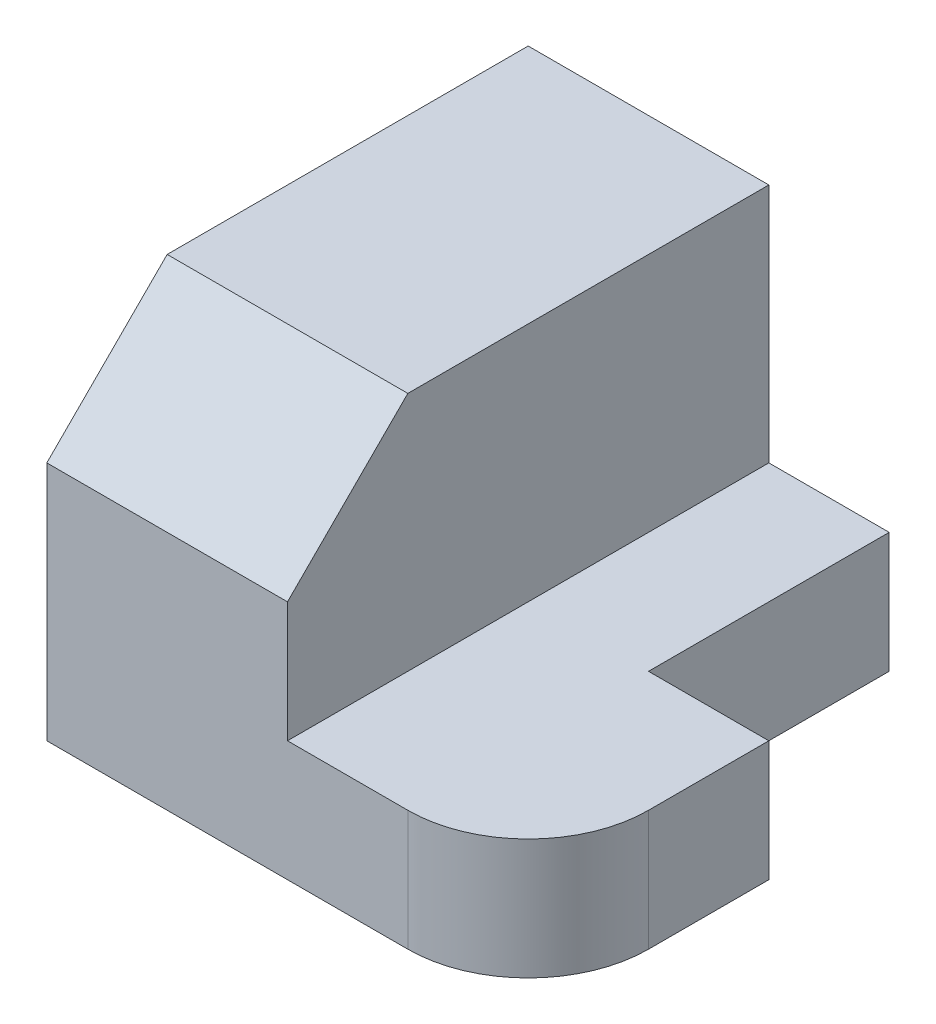
ISO-10303-21;
HEADER;
FILE_DESCRIPTION(('STEP AP214'),'2;1');
FILE_NAME('part.step','',(''),(''),'','','');
FILE_SCHEMA(('AUTOMOTIVE_DESIGN { 1 0 10303 214 1 1 1 1 }'));
ENDSEC;
DATA;
#1=APPLICATION_CONTEXT('core data for automotive mechanical design processes');
#2=APPLICATION_PROTOCOL_DEFINITION('international standard','automotive_design',2000,#1);
#3=PRODUCT_CONTEXT('',#1,'mechanical');
#4=PRODUCT('Part','Part','',(#3));
#5=PRODUCT_RELATED_PRODUCT_CATEGORY('part','',(#4));
#6=PRODUCT_DEFINITION_FORMATION('','',#4);
#7=PRODUCT_DEFINITION_CONTEXT('part definition',#1,'design');
#8=PRODUCT_DEFINITION('design','',#6,#7);
#9=PRODUCT_DEFINITION_SHAPE('','',#8);
#10=(LENGTH_UNIT() NAMED_UNIT(*) SI_UNIT(.MILLI.,.METRE.));
#11=(NAMED_UNIT(*) PLANE_ANGLE_UNIT() SI_UNIT($,.RADIAN.));
#12=(NAMED_UNIT(*) SI_UNIT($,.STERADIAN.) SOLID_ANGLE_UNIT());
#13=UNCERTAINTY_MEASURE_WITH_UNIT(LENGTH_MEASURE(1.E-05),#10,'distance_accuracy_value','');
#14=(GEOMETRIC_REPRESENTATION_CONTEXT(3) GLOBAL_UNCERTAINTY_ASSIGNED_CONTEXT((#13)) GLOBAL_UNIT_ASSIGNED_CONTEXT((#10,
#11,#12)) REPRESENTATION_CONTEXT('',''));
#15=CARTESIAN_POINT('',(0.,0.,0.));
#16=DIRECTION('',(0.,0.,1.));
#17=DIRECTION('',(1.,0.,0.));
#18=AXIS2_PLACEMENT_3D('',#15,#16,#17);
#19=CARTESIAN_POINT('',(3.44575101599363,6.03394564277327,0.993338960307057));
#20=DIRECTION('',(0.,-1.,0.));
#21=DIRECTION('',(0.,0.,-1.));
#22=AXIS2_PLACEMENT_3D('',#19,#20,#21);
#23=CYLINDRICAL_SURFACE('',#22,1.);
#24=CARTESIAN_POINT('',(3.44575101599363,5.03394564277327,0.993338960307057));
#25=DIRECTION('',(0.,1.,0.));
#26=DIRECTION('',(0.,0.,1.));
#27=AXIS2_PLACEMENT_3D('',#24,#25,#26);
#28=CIRCLE('',#27,1.);
#29=CARTESIAN_POINT('',(4.44575101599363,5.03394564277327,0.99333896030705));
#30=VERTEX_POINT('',#29);
#31=CARTESIAN_POINT('',(3.44575101599362,5.03394564277327,1.99333896030706));
#32=VERTEX_POINT('',#31);
#33=EDGE_CURVE('E132',#30,#32,#28,.F.);
#34=ORIENTED_EDGE('',*,*,#33,.F.);
#35=DIRECTION('',(0.,-1.,0.));
#36=VECTOR('',#35,1.);
#37=CARTESIAN_POINT('',(4.44575101599363,6.03394564277327,0.99333896030705));
#38=LINE('',#37,#36);
#39=CARTESIAN_POINT('',(4.44575101599363,6.03394564277327,0.99333896030705));
#40=VERTEX_POINT('',#39);
#41=EDGE_CURVE('E45',#40,#30,#38,.T.);
#42=ORIENTED_EDGE('',*,*,#41,.F.);
#43=CARTESIAN_POINT('',(3.44575101599363,6.03394564277327,0.993338960307057));
#44=DIRECTION('',(0.,1.,0.));
#45=DIRECTION('',(0.,0.,1.));
#46=AXIS2_PLACEMENT_3D('',#43,#44,#45);
#47=CIRCLE('',#46,1.);
#48=CARTESIAN_POINT('',(3.44575101599362,6.03394564277327,1.99333896030706));
#49=VERTEX_POINT('',#48);
#50=EDGE_CURVE('E147',#40,#49,#47,.F.);
#51=ORIENTED_EDGE('',*,*,#50,.T.);
#52=DIRECTION('',(0.,-1.,0.));
#53=VECTOR('',#52,1.);
#54=CARTESIAN_POINT('',(3.44575101599362,6.03394564277327,1.99333896030706));
#55=LINE('',#54,#53);
#56=EDGE_CURVE('E85',#49,#32,#55,.T.);
#57=ORIENTED_EDGE('',*,*,#56,.T.);
#58=EDGE_LOOP('',(#34,#42,#51,#57));
#59=FACE_BOUND('',#58,.T.);
#60=ADVANCED_FACE('F38',(#59),#23,.T.);
#61=CARTESIAN_POINT('',(4.44575101599363,6.03394564277327,-0.00666103969294385));
#62=DIRECTION('',(1.,0.,0.));
#63=DIRECTION('',(0.,0.,-1.));
#64=AXIS2_PLACEMENT_3D('',#61,#62,#63);
#65=PLANE('',#64);
#66=DIRECTION('',(0.,0.,1.));
#67=VECTOR('',#66,1.);
#68=CARTESIAN_POINT('',(4.44575101599363,5.03394564277327,-0.00666103969294385));
#69=LINE('',#68,#67);
#70=CARTESIAN_POINT('',(4.44575101599363,5.03394564277327,-0.00666103969294281));
#71=VERTEX_POINT('',#70);
#72=EDGE_CURVE('E135',#71,#30,#69,.T.);
#73=ORIENTED_EDGE('',*,*,#72,.F.);
#74=DIRECTION('',(0.,-1.,0.));
#75=VECTOR('',#74,1.);
#76=CARTESIAN_POINT('',(4.44575101599363,6.03394564277327,-0.00666103969294281));
#77=LINE('',#76,#75);
#78=CARTESIAN_POINT('',(4.44575101599363,6.03394564277327,-0.00666103969294281));
#79=VERTEX_POINT('',#78);
#80=EDGE_CURVE('E150',#79,#71,#77,.T.);
#81=ORIENTED_EDGE('',*,*,#80,.F.);
#82=DIRECTION('',(0.,0.,1.));
#83=VECTOR('',#82,1.);
#84=CARTESIAN_POINT('',(4.44575101599363,6.03394564277327,-0.00666103969294385));
#85=LINE('',#84,#83);
#86=EDGE_CURVE('E155',#79,#40,#85,.T.);
#87=ORIENTED_EDGE('',*,*,#86,.T.);
#88=ORIENTED_EDGE('',*,*,#41,.T.);
#89=EDGE_LOOP('',(#73,#81,#87,#88));
#90=FACE_BOUND('',#89,.T.);
#91=ADVANCED_FACE('F154',(#90),#65,.T.);
#92=CARTESIAN_POINT('',(1.44575101599362,6.03394564277327,-0.00666103969294242));
#93=DIRECTION('',(0.,0.,1.));
#94=DIRECTION('',(1.,0.,0.));
#95=AXIS2_PLACEMENT_3D('',#92,#93,#94);
#96=PLANE('',#95);
#97=DIRECTION('',(-1.,0.,0.));
#98=VECTOR('',#97,1.);
#99=CARTESIAN_POINT('',(1.44575101599362,5.03394564277327,-0.00666103969294242));
#100=LINE('',#99,#98);
#101=CARTESIAN_POINT('',(3.44575101599362,5.03394564277327,-0.00666103969294268));
#102=VERTEX_POINT('',#101);
#103=EDGE_CURVE('E139',#71,#102,#100,.T.);
#104=ORIENTED_EDGE('',*,*,#103,.T.);
#105=DIRECTION('',(0.,-1.,0.));
#106=VECTOR('',#105,1.);
#107=CARTESIAN_POINT('',(3.44575101599362,6.03394564277327,-0.00666103969294268));
#108=LINE('',#107,#106);
#109=CARTESIAN_POINT('',(3.44575101599362,6.03394564277327,-0.00666103969294268));
#110=VERTEX_POINT('',#109);
#111=EDGE_CURVE('E111',#110,#102,#108,.T.);
#112=ORIENTED_EDGE('',*,*,#111,.F.);
#113=DIRECTION('',(-1.,0.,0.));
#114=VECTOR('',#113,1.);
#115=CARTESIAN_POINT('',(1.44575101599362,6.03394564277327,-0.00666103969294242));
#116=LINE('',#115,#114);
#117=EDGE_CURVE('E118',#79,#110,#116,.T.);
#118=ORIENTED_EDGE('',*,*,#117,.F.);
#119=ORIENTED_EDGE('',*,*,#80,.T.);
#120=EDGE_LOOP('',(#104,#112,#118,#119));
#121=FACE_BOUND('',#120,.T.);
#122=ADVANCED_FACE('F161',(#121),#96,.F.);
#123=CARTESIAN_POINT('',(3.44575101599362,6.03394564277327,-0.00666103969294281));
#124=DIRECTION('',(1.,0.,0.));
#125=DIRECTION('',(0.,0.,-1.));
#126=AXIS2_PLACEMENT_3D('',#123,#124,#125);
#127=PLANE('',#126);
#128=DIRECTION('',(0.,0.,1.));
#129=VECTOR('',#128,1.);
#130=CARTESIAN_POINT('',(3.44575101599362,5.03394564277327,-0.00666103969294281));
#131=LINE('',#130,#129);
#132=CARTESIAN_POINT('',(3.44575101599362,5.03394564277327,-2.00666103969294));
#133=VERTEX_POINT('',#132);
#134=EDGE_CURVE('E106',#133,#102,#131,.T.);
#135=ORIENTED_EDGE('',*,*,#134,.F.);
#136=DIRECTION('',(0.,-1.,0.));
#137=VECTOR('',#136,1.);
#138=CARTESIAN_POINT('',(3.44575101599362,6.03394564277327,-2.00666103969294));
#139=LINE('',#138,#137);
#140=CARTESIAN_POINT('',(3.44575101599362,6.03394564277327,-2.00666103969294));
#141=VERTEX_POINT('',#140);
#142=EDGE_CURVE('E101',#141,#133,#139,.T.);
#143=ORIENTED_EDGE('',*,*,#142,.F.);
#144=DIRECTION('',(0.,0.,1.));
#145=VECTOR('',#144,1.);
#146=CARTESIAN_POINT('',(3.44575101599362,6.03394564277327,-0.00666103969294281));
#147=LINE('',#146,#145);
#148=EDGE_CURVE('E104',#141,#110,#147,.T.);
#149=ORIENTED_EDGE('',*,*,#148,.T.);
#150=ORIENTED_EDGE('',*,*,#111,.T.);
#151=EDGE_LOOP('',(#135,#143,#149,#150));
#152=FACE_BOUND('',#151,.T.);
#153=ADVANCED_FACE('F103',(#152),#127,.T.);
#154=CARTESIAN_POINT('',(1.44575101599362,6.03394564277327,-2.00666103969294));
#155=DIRECTION('',(0.,0.,-1.));
#156=DIRECTION('',(-1.,0.,0.));
#157=AXIS2_PLACEMENT_3D('',#154,#155,#156);
#158=PLANE('',#157);
#159=DIRECTION('',(1.,0.,0.));
#160=VECTOR('',#159,1.);
#161=CARTESIAN_POINT('',(1.44575101599362,5.03394564277327,-2.00666103969294));
#162=LINE('',#161,#160);
#163=CARTESIAN_POINT('',(0.445751015993624,5.03394564277327,-2.00666103969294));
#164=VERTEX_POINT('',#163);
#165=EDGE_CURVE('E143',#164,#133,#162,.T.);
#166=ORIENTED_EDGE('',*,*,#165,.F.);
#167=DIRECTION('',(0.,-1.,0.));
#168=VECTOR('',#167,1.);
#169=CARTESIAN_POINT('',(0.445751015993624,8.03394564277327,-2.00666103969294));
#170=LINE('',#169,#168);
#171=CARTESIAN_POINT('',(0.445751015993624,8.03394564277327,-2.00666103969294));
#172=VERTEX_POINT('',#171);
#173=EDGE_CURVE('E170',#172,#164,#170,.T.);
#174=ORIENTED_EDGE('',*,*,#173,.F.);
#175=DIRECTION('',(-1.,0.,0.));
#176=VECTOR('',#175,1.);
#177=CARTESIAN_POINT('',(1.44575101599362,8.03394564277327,-2.00666103969294));
#178=LINE('',#177,#176);
#179=CARTESIAN_POINT('',(2.44575101599362,8.03394564277327,-2.00666103969294));
#180=VERTEX_POINT('',#179);
#181=EDGE_CURVE('E173',#180,#172,#178,.T.);
#182=ORIENTED_EDGE('',*,*,#181,.F.);
#183=DIRECTION('',(0.,-1.,0.));
#184=VECTOR('',#183,1.);
#185=CARTESIAN_POINT('',(2.44575101599362,8.03394564277327,-2.00666103969294));
#186=LINE('',#185,#184);
#187=CARTESIAN_POINT('',(2.44575101599362,6.03394564277327,-2.00666103969294));
#188=VERTEX_POINT('',#187);
#189=EDGE_CURVE('E125',#180,#188,#186,.T.);
#190=ORIENTED_EDGE('',*,*,#189,.T.);
#191=DIRECTION('',(1.,0.,0.));
#192=VECTOR('',#191,1.);
#193=CARTESIAN_POINT('',(1.44575101599362,6.03394564277327,-2.00666103969294));
#194=LINE('',#193,#192);
#195=EDGE_CURVE('E115',#188,#141,#194,.T.);
#196=ORIENTED_EDGE('',*,*,#195,.T.);
#197=ORIENTED_EDGE('',*,*,#142,.T.);
#198=EDGE_LOOP('',(#166,#174,#182,#190,#196,#197));
#199=FACE_BOUND('',#198,.T.);
#200=ADVANCED_FACE('F122',(#199),#158,.T.);
#201=CARTESIAN_POINT('',(1.44575101599362,6.03394564277327,1.99333896030706));
#202=DIRECTION('',(0.,0.,-1.));
#203=DIRECTION('',(-1.,0.,0.));
#204=AXIS2_PLACEMENT_3D('',#201,#202,#203);
#205=PLANE('',#204);
#206=DIRECTION('',(0.,-1.,0.));
#207=VECTOR('',#206,1.);
#208=CARTESIAN_POINT('',(2.44575101599362,8.03394564277327,1.99333896030706));
#209=LINE('',#208,#207);
#210=CARTESIAN_POINT('',(2.44575101599362,7.03394564277327,1.99333896030706));
#211=VERTEX_POINT('',#210);
#212=CARTESIAN_POINT('',(2.44575101599362,6.03394564277327,1.99333896030706));
#213=VERTEX_POINT('',#212);
#214=EDGE_CURVE('E167',#211,#213,#209,.T.);
#215=ORIENTED_EDGE('',*,*,#214,.F.);
#216=DIRECTION('',(-1.,0.,0.));
#217=VECTOR('',#216,1.);
#218=CARTESIAN_POINT('',(3.44575101599363,7.03394564277327,1.99333896030706));
#219=LINE('',#218,#217);
#220=CARTESIAN_POINT('',(0.445751015993625,7.03394564277327,1.99333896030706));
#221=VERTEX_POINT('',#220);
#222=EDGE_CURVE('E186',#211,#221,#219,.T.);
#223=ORIENTED_EDGE('',*,*,#222,.T.);
#224=DIRECTION('',(0.,-1.,0.));
#225=VECTOR('',#224,1.);
#226=CARTESIAN_POINT('',(0.445751015993625,8.03394564277327,1.99333896030706));
#227=LINE('',#226,#225);
#228=CARTESIAN_POINT('',(0.445751015993625,5.03394564277327,1.99333896030706));
#229=VERTEX_POINT('',#228);
#230=EDGE_CURVE('E136',#221,#229,#227,.T.);
#231=ORIENTED_EDGE('',*,*,#230,.T.);
#232=DIRECTION('',(1.,0.,0.));
#233=VECTOR('',#232,1.);
#234=CARTESIAN_POINT('',(1.44575101599362,5.03394564277327,1.99333896030706));
#235=LINE('',#234,#233);
#236=EDGE_CURVE('E145',#229,#32,#235,.T.);
#237=ORIENTED_EDGE('',*,*,#236,.T.);
#238=ORIENTED_EDGE('',*,*,#56,.F.);
#239=DIRECTION('',(1.,0.,0.));
#240=VECTOR('',#239,1.);
#241=CARTESIAN_POINT('',(1.44575101599362,6.03394564277327,1.99333896030706));
#242=LINE('',#241,#240);
#243=EDGE_CURVE('E60',#213,#49,#242,.T.);
#244=ORIENTED_EDGE('',*,*,#243,.F.);
#245=EDGE_LOOP('',(#215,#223,#231,#237,#238,#244));
#246=FACE_BOUND('',#245,.T.);
#247=ADVANCED_FACE('F202',(#246),#205,.F.);
#248=CARTESIAN_POINT('',(1.44575101599362,6.03394564277327,-0.00666103969294281));
#249=DIRECTION('',(0.,1.,0.));
#250=DIRECTION('',(0.,0.,1.));
#251=AXIS2_PLACEMENT_3D('',#248,#249,#250);
#252=PLANE('',#251);
#253=ORIENTED_EDGE('',*,*,#50,.F.);
#254=ORIENTED_EDGE('',*,*,#86,.F.);
#255=ORIENTED_EDGE('',*,*,#117,.T.);
#256=ORIENTED_EDGE('',*,*,#148,.F.);
#257=ORIENTED_EDGE('',*,*,#195,.F.);
#258=DIRECTION('',(0.,0.,1.));
#259=VECTOR('',#258,1.);
#260=CARTESIAN_POINT('',(2.44575101599362,6.03394564277327,-0.00666103969294294));
#261=LINE('',#260,#259);
#262=EDGE_CURVE('E126',#188,#213,#261,.T.);
#263=ORIENTED_EDGE('',*,*,#262,.T.);
#264=ORIENTED_EDGE('',*,*,#243,.T.);
#265=EDGE_LOOP('',(#253,#254,#255,#256,#257,#263,#264));
#266=FACE_BOUND('',#265,.T.);
#267=ADVANCED_FACE('F114',(#266),#252,.T.);
#268=CARTESIAN_POINT('',(1.44575101599362,5.03394564277327,-0.00666103969294281));
#269=DIRECTION('',(0.,1.,0.));
#270=DIRECTION('',(0.,0.,1.));
#271=AXIS2_PLACEMENT_3D('',#268,#269,#270);
#272=PLANE('',#271);
#273=ORIENTED_EDGE('',*,*,#33,.T.);
#274=ORIENTED_EDGE('',*,*,#236,.F.);
#275=DIRECTION('',(0.,0.,1.));
#276=VECTOR('',#275,1.);
#277=CARTESIAN_POINT('',(0.445751015993625,5.03394564277327,-0.00666103969294264));
#278=LINE('',#277,#276);
#279=EDGE_CURVE('E174',#164,#229,#278,.T.);
#280=ORIENTED_EDGE('',*,*,#279,.F.);
#281=ORIENTED_EDGE('',*,*,#165,.T.);
#282=ORIENTED_EDGE('',*,*,#134,.T.);
#283=ORIENTED_EDGE('',*,*,#103,.F.);
#284=ORIENTED_EDGE('',*,*,#72,.T.);
#285=EDGE_LOOP('',(#273,#274,#280,#281,#282,#283,#284));
#286=FACE_BOUND('',#285,.T.);
#287=ADVANCED_FACE('F159',(#286),#272,.F.);
#288=CARTESIAN_POINT('',(2.44575101599362,8.03394564277327,-0.00666103969294294));
#289=DIRECTION('',(1.,0.,0.));
#290=DIRECTION('',(0.,0.,-1.));
#291=AXIS2_PLACEMENT_3D('',#288,#289,#290);
#292=PLANE('',#291);
#293=DIRECTION('',(0.,0.707106781186548,-0.707106781186548));
#294=VECTOR('',#293,1.);
#295=CARTESIAN_POINT('',(2.44575101599362,8.53394564277327,0.493338960307057));
#296=LINE('',#295,#294);
#297=CARTESIAN_POINT('',(2.44575101599362,8.03394564277327,0.993338960307057));
#298=VERTEX_POINT('',#297);
#299=EDGE_CURVE('E51',#211,#298,#296,.T.);
#300=ORIENTED_EDGE('',*,*,#299,.F.);
#301=ORIENTED_EDGE('',*,*,#214,.T.);
#302=ORIENTED_EDGE('',*,*,#262,.F.);
#303=ORIENTED_EDGE('',*,*,#189,.F.);
#304=DIRECTION('',(0.,0.,1.));
#305=VECTOR('',#304,1.);
#306=CARTESIAN_POINT('',(2.44575101599362,8.03394564277327,-0.00666103969294294));
#307=LINE('',#306,#305);
#308=EDGE_CURVE('E180',#180,#298,#307,.T.);
#309=ORIENTED_EDGE('',*,*,#308,.T.);
#310=EDGE_LOOP('',(#300,#301,#302,#303,#309));
#311=FACE_BOUND('',#310,.T.);
#312=ADVANCED_FACE('F219',(#311),#292,.T.);
#313=CARTESIAN_POINT('',(0.445751015993625,8.03394564277327,-0.00666103969294264));
#314=DIRECTION('',(1.,0.,0.));
#315=DIRECTION('',(0.,0.,-1.));
#316=AXIS2_PLACEMENT_3D('',#313,#314,#315);
#317=PLANE('',#316);
#318=ORIENTED_EDGE('',*,*,#230,.F.);
#319=DIRECTION('',(0.,-0.707106781186548,0.707106781186548));
#320=VECTOR('',#319,1.);
#321=CARTESIAN_POINT('',(0.445751015993625,8.03394564277327,0.993338960307057));
#322=LINE('',#321,#320);
#323=CARTESIAN_POINT('',(0.445751015993625,8.03394564277327,0.993338960307057));
#324=VERTEX_POINT('',#323);
#325=EDGE_CURVE('E189',#324,#221,#322,.T.);
#326=ORIENTED_EDGE('',*,*,#325,.F.);
#327=DIRECTION('',(0.,0.,1.));
#328=VECTOR('',#327,1.);
#329=CARTESIAN_POINT('',(0.445751015993625,8.03394564277327,-0.00666103969294264));
#330=LINE('',#329,#328);
#331=EDGE_CURVE('E177',#172,#324,#330,.T.);
#332=ORIENTED_EDGE('',*,*,#331,.F.);
#333=ORIENTED_EDGE('',*,*,#173,.T.);
#334=ORIENTED_EDGE('',*,*,#279,.T.);
#335=EDGE_LOOP('',(#318,#326,#332,#333,#334));
#336=FACE_BOUND('',#335,.T.);
#337=ADVANCED_FACE('F204',(#336),#317,.F.);
#338=CARTESIAN_POINT('',(1.44575101599362,8.03394564277327,-0.00666103969294281));
#339=DIRECTION('',(0.,1.,0.));
#340=DIRECTION('',(0.,0.,1.));
#341=AXIS2_PLACEMENT_3D('',#338,#339,#340);
#342=PLANE('',#341);
#343=DIRECTION('',(-1.,0.,0.));
#344=VECTOR('',#343,1.);
#345=CARTESIAN_POINT('',(1.44575101599362,8.03394564277327,0.993338960307057));
#346=LINE('',#345,#344);
#347=EDGE_CURVE('E11',#298,#324,#346,.T.);
#348=ORIENTED_EDGE('',*,*,#347,.F.);
#349=ORIENTED_EDGE('',*,*,#308,.F.);
#350=ORIENTED_EDGE('',*,*,#181,.T.);
#351=ORIENTED_EDGE('',*,*,#331,.T.);
#352=EDGE_LOOP('',(#348,#349,#350,#351));
#353=FACE_BOUND('',#352,.T.);
#354=ADVANCED_FACE('F220',(#353),#342,.T.);
#355=CARTESIAN_POINT('',(3.44575101599363,8.03394564277327,0.993338960307057));
#356=DIRECTION('',(0.,-0.707106781186547,-0.707106781186547));
#357=DIRECTION('',(0.,0.707106781186548,-0.707106781186548));
#358=AXIS2_PLACEMENT_3D('',#355,#356,#357);
#359=PLANE('',#358);
#360=ORIENTED_EDGE('',*,*,#299,.T.);
#361=ORIENTED_EDGE('',*,*,#347,.T.);
#362=ORIENTED_EDGE('',*,*,#325,.T.);
#363=ORIENTED_EDGE('',*,*,#222,.F.);
#364=EDGE_LOOP('',(#360,#361,#362,#363));
#365=FACE_BOUND('',#364,.T.);
#366=ADVANCED_FACE('F193',(#365),#359,.F.);
#367=CLOSED_SHELL('',(#60,#91,#122,#153,#200,#247,#267,#287,#312,#337,#354,#366));
#368=MANIFOLD_SOLID_BREP('B2',#367);
#369=ADVANCED_BREP_SHAPE_REPRESENTATION('',(#18,#368),#14);
#370=SHAPE_DEFINITION_REPRESENTATION(#9,#369);
ENDSEC;
END-ISO-10303-21;
